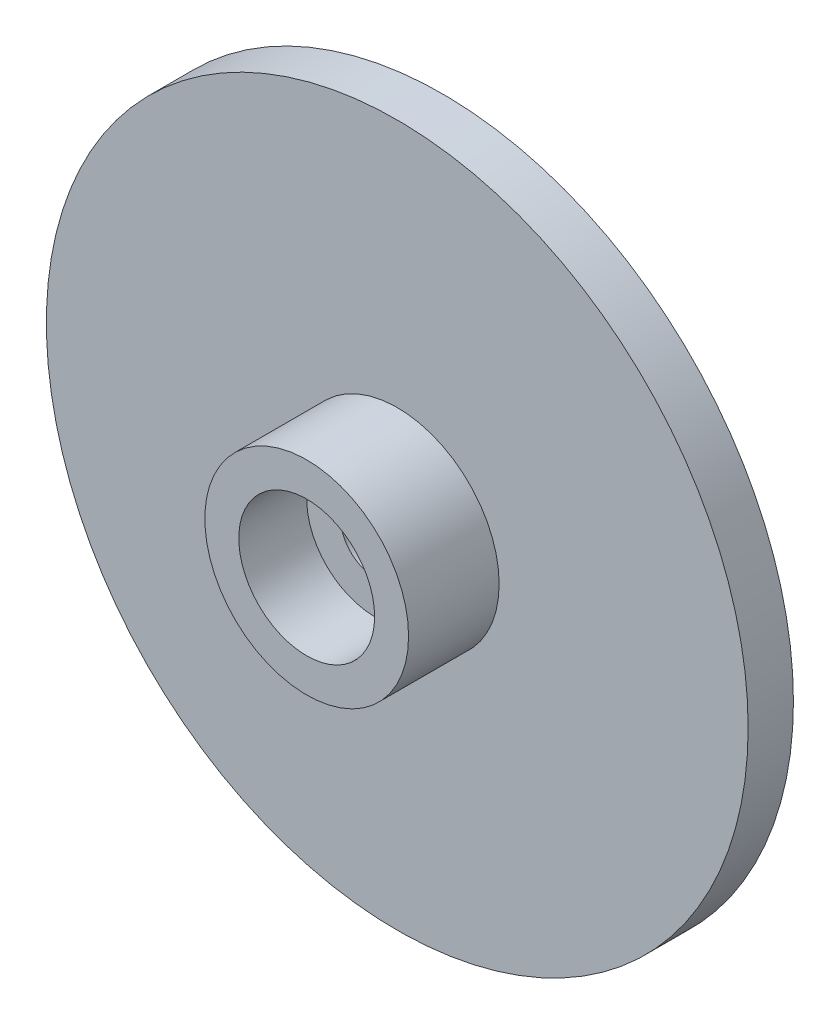
ISO-10303-21;
HEADER;
FILE_DESCRIPTION(('STEP AP214'),'2;1');
FILE_NAME('part.step','',(''),(''),'','','');
FILE_SCHEMA(('AUTOMOTIVE_DESIGN { 1 0 10303 214 1 1 1 1 }'));
ENDSEC;
DATA;
#1=APPLICATION_CONTEXT('core data for automotive mechanical design processes');
#2=APPLICATION_PROTOCOL_DEFINITION('international standard','automotive_design',2000,#1);
#3=PRODUCT_CONTEXT('',#1,'mechanical');
#4=PRODUCT('Part','Part','',(#3));
#5=PRODUCT_RELATED_PRODUCT_CATEGORY('part','',(#4));
#6=PRODUCT_DEFINITION_FORMATION('','',#4);
#7=PRODUCT_DEFINITION_CONTEXT('part definition',#1,'design');
#8=PRODUCT_DEFINITION('design','',#6,#7);
#9=PRODUCT_DEFINITION_SHAPE('','',#8);
#10=(LENGTH_UNIT() NAMED_UNIT(*) SI_UNIT(.MILLI.,.METRE.));
#11=(NAMED_UNIT(*) PLANE_ANGLE_UNIT() SI_UNIT($,.RADIAN.));
#12=(NAMED_UNIT(*) SI_UNIT($,.STERADIAN.) SOLID_ANGLE_UNIT());
#13=UNCERTAINTY_MEASURE_WITH_UNIT(LENGTH_MEASURE(1.E-05),#10,'distance_accuracy_value','');
#14=(GEOMETRIC_REPRESENTATION_CONTEXT(3) GLOBAL_UNCERTAINTY_ASSIGNED_CONTEXT((#13)) GLOBAL_UNIT_ASSIGNED_CONTEXT((#10,
#11,#12)) REPRESENTATION_CONTEXT('',''));
#15=CARTESIAN_POINT('',(0.,0.,0.));
#16=DIRECTION('',(0.,0.,1.));
#17=DIRECTION('',(1.,0.,0.));
#18=AXIS2_PLACEMENT_3D('',#15,#16,#17);
#19=CARTESIAN_POINT('',(0.,0.,2.));
#20=DIRECTION('',(0.,0.,1.));
#21=DIRECTION('',(1.,0.,0.));
#22=AXIS2_PLACEMENT_3D('',#19,#20,#21);
#23=PLANE('',#22);
#24=CARTESIAN_POINT('',(0.,0.,2.));
#25=DIRECTION('',(0.,0.,1.));
#26=DIRECTION('',(1.,0.,0.));
#27=AXIS2_PLACEMENT_3D('',#24,#25,#26);
#28=CIRCLE('',#27,15.5);
#29=CARTESIAN_POINT('',(15.5,0.,2.));
#30=VERTEX_POINT('',#29);
#31=EDGE_CURVE('E45',#30,#30,#28,.T.);
#32=ORIENTED_EDGE('',*,*,#31,.T.);
#33=EDGE_LOOP('',(#32));
#34=FACE_BOUND('',#33,.T.);
#35=CARTESIAN_POINT('',(0.,0.,2.));
#36=DIRECTION('',(0.,0.,1.));
#37=DIRECTION('',(1.,0.,0.));
#38=AXIS2_PLACEMENT_3D('',#35,#36,#37);
#39=CIRCLE('',#38,4.5);
#40=CARTESIAN_POINT('',(4.5,0.,2.));
#41=VERTEX_POINT('',#40);
#42=EDGE_CURVE('E56',#41,#41,#39,.T.);
#43=ORIENTED_EDGE('',*,*,#42,.F.);
#44=EDGE_LOOP('',(#43));
#45=FACE_BOUND('',#44,.T.);
#46=ADVANCED_FACE('F38',(#34,#45),#23,.T.);
#47=CARTESIAN_POINT('',(0.,0.,2.));
#48=DIRECTION('',(0.,0.,-1.));
#49=DIRECTION('',(-1.,0.,0.));
#50=AXIS2_PLACEMENT_3D('',#47,#48,#49);
#51=CYLINDRICAL_SURFACE('',#50,15.5);
#52=ORIENTED_EDGE('',*,*,#31,.F.);
#53=EDGE_LOOP('',(#52));
#54=FACE_BOUND('',#53,.T.);
#55=CARTESIAN_POINT('',(0.,0.,0.));
#56=DIRECTION('',(0.,0.,1.));
#57=DIRECTION('',(1.,0.,0.));
#58=AXIS2_PLACEMENT_3D('',#55,#56,#57);
#59=CIRCLE('',#58,15.5);
#60=CARTESIAN_POINT('',(15.5,0.,0.));
#61=VERTEX_POINT('',#60);
#62=EDGE_CURVE('E49',#61,#61,#59,.T.);
#63=ORIENTED_EDGE('',*,*,#62,.T.);
#64=EDGE_LOOP('',(#63));
#65=FACE_BOUND('',#64,.T.);
#66=ADVANCED_FACE('F40',(#54,#65),#51,.T.);
#67=CARTESIAN_POINT('',(0.,0.,0.));
#68=DIRECTION('',(0.,0.,1.));
#69=DIRECTION('',(1.,0.,0.));
#70=AXIS2_PLACEMENT_3D('',#67,#68,#69);
#71=PLANE('',#70);
#72=CARTESIAN_POINT('',(0.,0.,0.));
#73=DIRECTION('',(0.,0.,-1.));
#74=DIRECTION('',(-1.,0.,0.));
#75=AXIS2_PLACEMENT_3D('',#72,#73,#74);
#76=CIRCLE('',#75,4.5);
#77=CARTESIAN_POINT('',(-4.5,0.,0.));
#78=VERTEX_POINT('',#77);
#79=EDGE_CURVE('E71',#78,#78,#76,.T.);
#80=ORIENTED_EDGE('',*,*,#79,.F.);
#81=EDGE_LOOP('',(#80));
#82=FACE_BOUND('',#81,.T.);
#83=ORIENTED_EDGE('',*,*,#62,.F.);
#84=EDGE_LOOP('',(#83));
#85=FACE_BOUND('',#84,.T.);
#86=ADVANCED_FACE('F107',(#82,#85),#71,.F.);
#87=CARTESIAN_POINT('',(0.,0.,6.));
#88=DIRECTION('',(0.,0.,1.));
#89=DIRECTION('',(1.,0.,0.));
#90=AXIS2_PLACEMENT_3D('',#87,#88,#89);
#91=PLANE('',#90);
#92=CARTESIAN_POINT('',(0.,0.,6.));
#93=DIRECTION('',(0.,0.,1.));
#94=DIRECTION('',(1.,0.,0.));
#95=AXIS2_PLACEMENT_3D('',#92,#93,#94);
#96=CIRCLE('',#95,4.5);
#97=CARTESIAN_POINT('',(4.5,0.,6.));
#98=VERTEX_POINT('',#97);
#99=EDGE_CURVE('E54',#98,#98,#96,.T.);
#100=ORIENTED_EDGE('',*,*,#99,.T.);
#101=EDGE_LOOP('',(#100));
#102=FACE_BOUND('',#101,.T.);
#103=CARTESIAN_POINT('',(0.,0.,6.));
#104=DIRECTION('',(0.,0.,1.));
#105=DIRECTION('',(1.,0.,0.));
#106=AXIS2_PLACEMENT_3D('',#103,#104,#105);
#107=CIRCLE('',#106,3.);
#108=CARTESIAN_POINT('',(3.,0.,6.));
#109=VERTEX_POINT('',#108);
#110=EDGE_CURVE('E59',#109,#109,#107,.T.);
#111=ORIENTED_EDGE('',*,*,#110,.F.);
#112=EDGE_LOOP('',(#111));
#113=FACE_BOUND('',#112,.T.);
#114=ADVANCED_FACE('F136',(#102,#113),#91,.T.);
#115=CARTESIAN_POINT('',(0.,0.,6.));
#116=DIRECTION('',(0.,0.,-1.));
#117=DIRECTION('',(-1.,0.,0.));
#118=AXIS2_PLACEMENT_3D('',#115,#116,#117);
#119=CYLINDRICAL_SURFACE('',#118,4.5);
#120=ORIENTED_EDGE('',*,*,#99,.F.);
#121=EDGE_LOOP('',(#120));
#122=FACE_BOUND('',#121,.T.);
#123=ORIENTED_EDGE('',*,*,#42,.T.);
#124=EDGE_LOOP('',(#123));
#125=FACE_BOUND('',#124,.T.);
#126=ADVANCED_FACE('F133',(#122,#125),#119,.T.);
#127=CARTESIAN_POINT('',(0.,0.,6.));
#128=DIRECTION('',(0.,0.,-1.));
#129=DIRECTION('',(-1.,0.,0.));
#130=AXIS2_PLACEMENT_3D('',#127,#128,#129);
#131=CYLINDRICAL_SURFACE('',#130,3.);
#132=CARTESIAN_POINT('',(0.,0.,3.));
#133=DIRECTION('',(0.,0.,1.));
#134=DIRECTION('',(1.,0.,0.));
#135=AXIS2_PLACEMENT_3D('',#132,#133,#134);
#136=CIRCLE('',#135,3.);
#137=CARTESIAN_POINT('',(3.,0.,3.));
#138=VERTEX_POINT('',#137);
#139=EDGE_CURVE('E11',#138,#138,#136,.T.);
#140=ORIENTED_EDGE('',*,*,#139,.F.);
#141=EDGE_LOOP('',(#140));
#142=FACE_BOUND('',#141,.T.);
#143=ORIENTED_EDGE('',*,*,#110,.T.);
#144=EDGE_LOOP('',(#143));
#145=FACE_BOUND('',#144,.T.);
#146=ADVANCED_FACE('F122',(#142,#145),#131,.F.);
#147=CARTESIAN_POINT('',(0.,0.,3.));
#148=DIRECTION('',(0.,0.,1.));
#149=DIRECTION('',(1.,0.,0.));
#150=AXIS2_PLACEMENT_3D('',#147,#148,#149);
#151=PLANE('',#150);
#152=CARTESIAN_POINT('',(0.,0.,3.));
#153=DIRECTION('',(0.,0.,1.));
#154=DIRECTION('',(1.,0.,0.));
#155=AXIS2_PLACEMENT_3D('',#152,#153,#154);
#156=CIRCLE('',#155,1.5);
#157=CARTESIAN_POINT('',(1.5,0.,3.));
#158=VERTEX_POINT('',#157);
#159=EDGE_CURVE('E78',#158,#158,#156,.T.);
#160=ORIENTED_EDGE('',*,*,#159,.F.);
#161=EDGE_LOOP('',(#160));
#162=FACE_BOUND('',#161,.T.);
#163=ORIENTED_EDGE('',*,*,#139,.T.);
#164=EDGE_LOOP('',(#163));
#165=FACE_BOUND('',#164,.T.);
#166=ADVANCED_FACE('F113',(#162,#165),#151,.T.);
#167=CARTESIAN_POINT('',(0.,0.,1.));
#168=DIRECTION('',(0.,0.,-1.));
#169=DIRECTION('',(-1.,0.,0.));
#170=AXIS2_PLACEMENT_3D('',#167,#168,#169);
#171=CYLINDRICAL_SURFACE('',#170,3.5);
#172=CARTESIAN_POINT('',(0.,0.,1.));
#173=DIRECTION('',(0.,0.,-1.));
#174=DIRECTION('',(-1.,0.,0.));
#175=AXIS2_PLACEMENT_3D('',#172,#173,#174);
#176=CIRCLE('',#175,3.5);
#177=CARTESIAN_POINT('',(-3.5,0.,1.));
#178=VERTEX_POINT('',#177);
#179=EDGE_CURVE('E74',#178,#178,#176,.T.);
#180=ORIENTED_EDGE('',*,*,#179,.T.);
#181=EDGE_LOOP('',(#180));
#182=FACE_BOUND('',#181,.T.);
#183=CARTESIAN_POINT('',(0.,0.,0.));
#184=DIRECTION('',(0.,0.,-1.));
#185=DIRECTION('',(-1.,0.,0.));
#186=AXIS2_PLACEMENT_3D('',#183,#184,#185);
#187=CIRCLE('',#186,3.5);
#188=CARTESIAN_POINT('',(-3.5,0.,0.));
#189=VERTEX_POINT('',#188);
#190=EDGE_CURVE('E75',#189,#189,#187,.T.);
#191=ORIENTED_EDGE('',*,*,#190,.F.);
#192=EDGE_LOOP('',(#191));
#193=FACE_BOUND('',#192,.T.);
#194=ADVANCED_FACE('F110',(#182,#193),#171,.T.);
#195=CARTESIAN_POINT('',(0.,0.,1.));
#196=DIRECTION('',(0.,0.,-1.));
#197=DIRECTION('',(-1.,0.,0.));
#198=AXIS2_PLACEMENT_3D('',#195,#196,#197);
#199=CYLINDRICAL_SURFACE('',#198,4.5);
#200=CARTESIAN_POINT('',(0.,0.,1.));
#201=DIRECTION('',(0.,0.,-1.));
#202=DIRECTION('',(-1.,0.,0.));
#203=AXIS2_PLACEMENT_3D('',#200,#201,#202);
#204=CIRCLE('',#203,4.5);
#205=CARTESIAN_POINT('',(-4.5,0.,1.));
#206=VERTEX_POINT('',#205);
#207=EDGE_CURVE('E68',#206,#206,#204,.T.);
#208=ORIENTED_EDGE('',*,*,#207,.F.);
#209=EDGE_LOOP('',(#208));
#210=FACE_BOUND('',#209,.T.);
#211=ORIENTED_EDGE('',*,*,#79,.T.);
#212=EDGE_LOOP('',(#211));
#213=FACE_BOUND('',#212,.T.);
#214=ADVANCED_FACE('F112',(#210,#213),#199,.F.);
#215=CARTESIAN_POINT('',(0.,0.,1.));
#216=DIRECTION('',(0.,0.,-1.));
#217=DIRECTION('',(-1.,0.,0.));
#218=AXIS2_PLACEMENT_3D('',#215,#216,#217);
#219=PLANE('',#218);
#220=ORIENTED_EDGE('',*,*,#179,.F.);
#221=EDGE_LOOP('',(#220));
#222=FACE_BOUND('',#221,.T.);
#223=ORIENTED_EDGE('',*,*,#207,.T.);
#224=EDGE_LOOP('',(#223));
#225=FACE_BOUND('',#224,.T.);
#226=ADVANCED_FACE('F95',(#222,#225),#219,.T.);
#227=CARTESIAN_POINT('',(0.,0.,1.));
#228=DIRECTION('',(0.,0.,-1.));
#229=DIRECTION('',(-1.,0.,0.));
#230=AXIS2_PLACEMENT_3D('',#227,#228,#229);
#231=PLANE('',#230);
#232=CARTESIAN_POINT('',(0.,0.,1.));
#233=DIRECTION('',(0.,0.,-1.));
#234=DIRECTION('',(-1.,0.,0.));
#235=AXIS2_PLACEMENT_3D('',#232,#233,#234);
#236=CIRCLE('',#235,1.5);
#237=CARTESIAN_POINT('',(-1.5,0.,1.));
#238=VERTEX_POINT('',#237);
#239=EDGE_CURVE('E85',#238,#238,#236,.T.);
#240=ORIENTED_EDGE('',*,*,#239,.F.);
#241=EDGE_LOOP('',(#240));
#242=FACE_BOUND('',#241,.T.);
#243=CARTESIAN_POINT('',(0.,0.,1.));
#244=DIRECTION('',(0.,0.,-1.));
#245=DIRECTION('',(-1.,0.,0.));
#246=AXIS2_PLACEMENT_3D('',#243,#244,#245);
#247=CIRCLE('',#246,3.);
#248=CARTESIAN_POINT('',(-3.,0.,1.));
#249=VERTEX_POINT('',#248);
#250=EDGE_CURVE('E64',#249,#249,#247,.T.);
#251=ORIENTED_EDGE('',*,*,#250,.T.);
#252=EDGE_LOOP('',(#251));
#253=FACE_BOUND('',#252,.T.);
#254=ADVANCED_FACE('F91',(#242,#253),#231,.T.);
#255=CARTESIAN_POINT('',(0.,0.,1.));
#256=DIRECTION('',(0.,0.,-1.));
#257=DIRECTION('',(-1.,0.,0.));
#258=AXIS2_PLACEMENT_3D('',#255,#256,#257);
#259=CYLINDRICAL_SURFACE('',#258,3.);
#260=ORIENTED_EDGE('',*,*,#250,.F.);
#261=EDGE_LOOP('',(#260));
#262=FACE_BOUND('',#261,.T.);
#263=CARTESIAN_POINT('',(0.,0.,0.));
#264=DIRECTION('',(0.,0.,-1.));
#265=DIRECTION('',(-1.,0.,0.));
#266=AXIS2_PLACEMENT_3D('',#263,#264,#265);
#267=CIRCLE('',#266,3.);
#268=CARTESIAN_POINT('',(-3.,0.,0.));
#269=VERTEX_POINT('',#268);
#270=EDGE_CURVE('E65',#269,#269,#267,.T.);
#271=ORIENTED_EDGE('',*,*,#270,.T.);
#272=EDGE_LOOP('',(#271));
#273=FACE_BOUND('',#272,.T.);
#274=ADVANCED_FACE('F94',(#262,#273),#259,.F.);
#275=ORIENTED_EDGE('',*,*,#270,.F.);
#276=EDGE_LOOP('',(#275));
#277=FACE_BOUND('',#276,.T.);
#278=ORIENTED_EDGE('',*,*,#190,.T.);
#279=EDGE_LOOP('',(#278));
#280=FACE_BOUND('',#279,.T.);
#281=ADVANCED_FACE('F101',(#277,#280),#71,.F.);
#282=CARTESIAN_POINT('',(0.,0.,13.));
#283=DIRECTION('',(0.,0.,-1.));
#284=DIRECTION('',(-1.,0.,0.));
#285=AXIS2_PLACEMENT_3D('',#282,#283,#284);
#286=CYLINDRICAL_SURFACE('',#285,1.5);
#287=ORIENTED_EDGE('',*,*,#159,.T.);
#288=EDGE_LOOP('',(#287));
#289=FACE_BOUND('',#288,.T.);
#290=ORIENTED_EDGE('',*,*,#239,.T.);
#291=EDGE_LOOP('',(#290));
#292=FACE_BOUND('',#291,.T.);
#293=ADVANCED_FACE('F89',(#289,#292),#286,.F.);
#294=CLOSED_SHELL('',(#46,#66,#86,#114,#126,#146,#166,#194,#214,#226,#254,#274,#281,#293));
#295=MANIFOLD_SOLID_BREP('B2',#294);
#296=ADVANCED_BREP_SHAPE_REPRESENTATION('',(#18,#295),#14);
#297=SHAPE_DEFINITION_REPRESENTATION(#9,#296);
ENDSEC;
END-ISO-10303-21;
